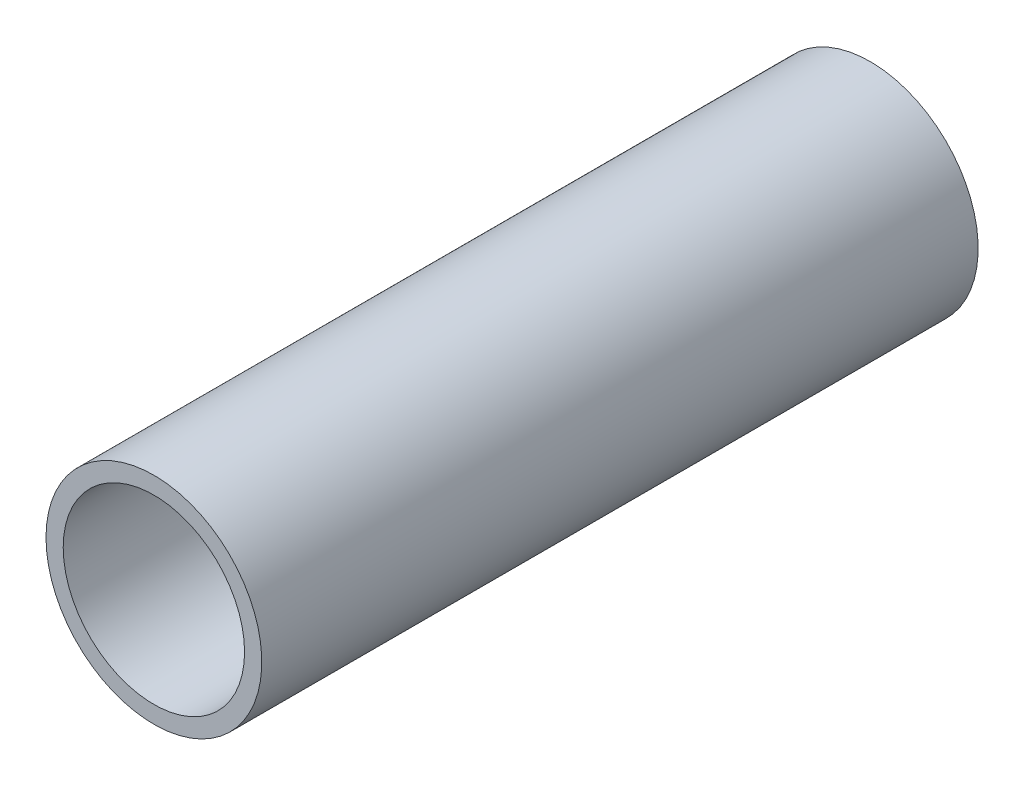
ISO-10303-21;
HEADER;
FILE_DESCRIPTION(('STEP AP214'),'2;1');
FILE_NAME('part.step','',(''),(''),'','','');
FILE_SCHEMA(('AUTOMOTIVE_DESIGN { 1 0 10303 214 1 1 1 1 }'));
ENDSEC;
DATA;
#1=APPLICATION_CONTEXT('core data for automotive mechanical design processes');
#2=APPLICATION_PROTOCOL_DEFINITION('international standard','automotive_design',2000,#1);
#3=PRODUCT_CONTEXT('',#1,'mechanical');
#4=PRODUCT('Part','Part','',(#3));
#5=PRODUCT_RELATED_PRODUCT_CATEGORY('part','',(#4));
#6=PRODUCT_DEFINITION_FORMATION('','',#4);
#7=PRODUCT_DEFINITION_CONTEXT('part definition',#1,'design');
#8=PRODUCT_DEFINITION('design','',#6,#7);
#9=PRODUCT_DEFINITION_SHAPE('','',#8);
#10=(LENGTH_UNIT() NAMED_UNIT(*) SI_UNIT(.MILLI.,.METRE.));
#11=(NAMED_UNIT(*) PLANE_ANGLE_UNIT() SI_UNIT($,.RADIAN.));
#12=(NAMED_UNIT(*) SI_UNIT($,.STERADIAN.) SOLID_ANGLE_UNIT());
#13=UNCERTAINTY_MEASURE_WITH_UNIT(LENGTH_MEASURE(1.E-05),#10,'distance_accuracy_value','');
#14=(GEOMETRIC_REPRESENTATION_CONTEXT(3) GLOBAL_UNCERTAINTY_ASSIGNED_CONTEXT((#13)) GLOBAL_UNIT_ASSIGNED_CONTEXT((#10,
#11,#12)) REPRESENTATION_CONTEXT('',''));
#15=CARTESIAN_POINT('',(0.,0.,0.));
#16=DIRECTION('',(0.,0.,1.));
#17=DIRECTION('',(1.,0.,0.));
#18=AXIS2_PLACEMENT_3D('',#15,#16,#17);
#19=CARTESIAN_POINT('',(0.,0.,31.75));
#20=DIRECTION('',(0.,0.,-1.));
#21=DIRECTION('',(-1.,0.,0.));
#22=AXIS2_PLACEMENT_3D('',#19,#20,#21);
#23=CYLINDRICAL_SURFACE('',#22,8.0391);
#24=CARTESIAN_POINT('',(0.,0.,-31.75));
#25=DIRECTION('',(0.,0.,-1.));
#26=DIRECTION('',(-1.,0.,0.));
#27=AXIS2_PLACEMENT_3D('',#24,#25,#26);
#28=CIRCLE('',#27,8.0391);
#29=CARTESIAN_POINT('',(-8.0391,0.,-31.75));
#30=VERTEX_POINT('',#29);
#31=EDGE_CURVE('E26',#30,#30,#28,.T.);
#32=ORIENTED_EDGE('',*,*,#31,.T.);
#33=EDGE_LOOP('',(#32));
#34=FACE_BOUND('',#33,.T.);
#35=CARTESIAN_POINT('',(0.,0.,31.75));
#36=DIRECTION('',(0.,0.,-1.));
#37=DIRECTION('',(-1.,0.,0.));
#38=AXIS2_PLACEMENT_3D('',#35,#36,#37);
#39=CIRCLE('',#38,8.0391);
#40=CARTESIAN_POINT('',(-8.0391,0.,31.75));
#41=VERTEX_POINT('',#40);
#42=EDGE_CURVE('E17',#41,#41,#39,.T.);
#43=ORIENTED_EDGE('',*,*,#42,.F.);
#44=EDGE_LOOP('',(#43));
#45=FACE_BOUND('',#44,.T.);
#46=ADVANCED_FACE('F14',(#34,#45),#23,.F.);
#47=CARTESIAN_POINT('',(0.,0.,31.75));
#48=DIRECTION('',(0.,0.,1.));
#49=DIRECTION('',(1.,0.,0.));
#50=AXIS2_PLACEMENT_3D('',#47,#48,#49);
#51=PLANE('',#50);
#52=ORIENTED_EDGE('',*,*,#42,.T.);
#53=EDGE_LOOP('',(#52));
#54=FACE_BOUND('',#53,.T.);
#55=CARTESIAN_POINT('',(0.,0.,31.75));
#56=DIRECTION('',(0.,0.,-1.));
#57=DIRECTION('',(-1.,0.,0.));
#58=AXIS2_PLACEMENT_3D('',#55,#56,#57);
#59=CIRCLE('',#58,9.5631);
#60=CARTESIAN_POINT('',(-9.5631,0.,31.75));
#61=VERTEX_POINT('',#60);
#62=EDGE_CURVE('E21',#61,#61,#59,.T.);
#63=ORIENTED_EDGE('',*,*,#62,.F.);
#64=EDGE_LOOP('',(#63));
#65=FACE_BOUND('',#64,.T.);
#66=ADVANCED_FACE('F34',(#54,#65),#51,.T.);
#67=CARTESIAN_POINT('',(0.,0.,-31.75));
#68=DIRECTION('',(0.,0.,1.));
#69=DIRECTION('',(1.,0.,0.));
#70=AXIS2_PLACEMENT_3D('',#67,#68,#69);
#71=PLANE('',#70);
#72=ORIENTED_EDGE('',*,*,#31,.F.);
#73=EDGE_LOOP('',(#72));
#74=FACE_BOUND('',#73,.T.);
#75=CARTESIAN_POINT('',(0.,0.,-31.75));
#76=DIRECTION('',(0.,0.,-1.));
#77=DIRECTION('',(-1.,0.,0.));
#78=AXIS2_PLACEMENT_3D('',#75,#76,#77);
#79=CIRCLE('',#78,9.5631);
#80=CARTESIAN_POINT('',(-9.5631,0.,-31.75));
#81=VERTEX_POINT('',#80);
#82=EDGE_CURVE('E10',#81,#81,#79,.F.);
#83=ORIENTED_EDGE('',*,*,#82,.F.);
#84=EDGE_LOOP('',(#83));
#85=FACE_BOUND('',#84,.T.);
#86=ADVANCED_FACE('F42',(#74,#85),#71,.F.);
#87=CARTESIAN_POINT('',(0.,0.,31.75));
#88=DIRECTION('',(0.,0.,-1.));
#89=DIRECTION('',(-1.,0.,0.));
#90=AXIS2_PLACEMENT_3D('',#87,#88,#89);
#91=CYLINDRICAL_SURFACE('',#90,9.5631);
#92=ORIENTED_EDGE('',*,*,#82,.T.);
#93=EDGE_LOOP('',(#92));
#94=FACE_BOUND('',#93,.T.);
#95=ORIENTED_EDGE('',*,*,#62,.T.);
#96=EDGE_LOOP('',(#95));
#97=FACE_BOUND('',#96,.T.);
#98=ADVANCED_FACE('F43',(#94,#97),#91,.T.);
#99=CLOSED_SHELL('',(#46,#66,#86,#98));
#100=MANIFOLD_SOLID_BREP('B1',#99);
#101=ADVANCED_BREP_SHAPE_REPRESENTATION('',(#18,#100),#14);
#102=SHAPE_DEFINITION_REPRESENTATION(#9,#101);
ENDSEC;
END-ISO-10303-21;
